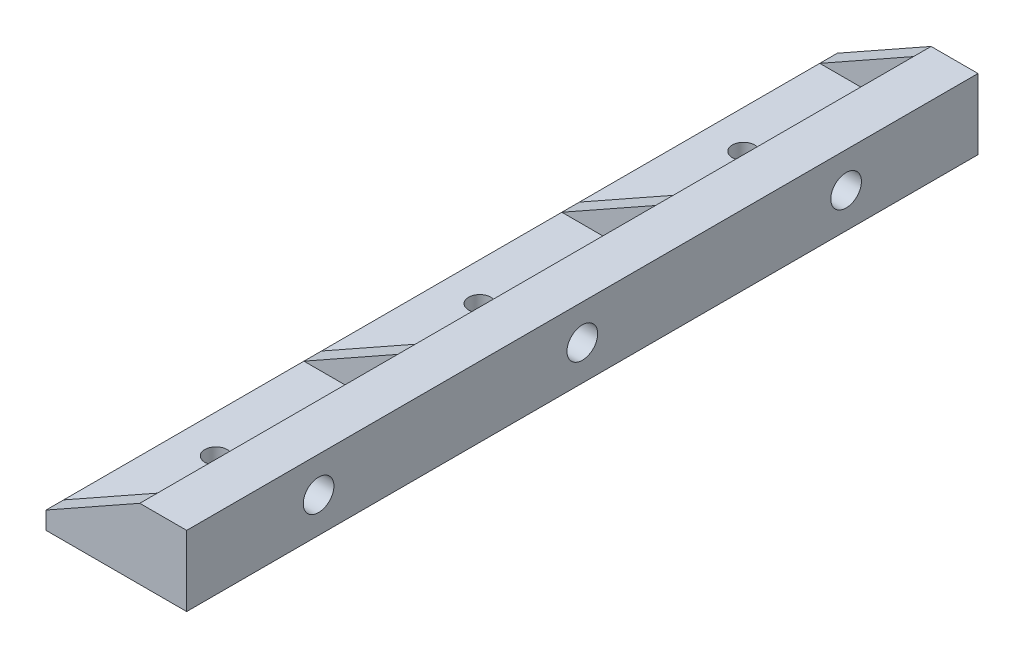
ISO-10303-21;
HEADER;
FILE_DESCRIPTION(('STEP AP214'),'2;1');
FILE_NAME('part.step','',(''),(''),'','','');
FILE_SCHEMA(('AUTOMOTIVE_DESIGN { 1 0 10303 214 1 1 1 1 }'));
ENDSEC;
DATA;
#1=APPLICATION_CONTEXT('core data for automotive mechanical design processes');
#2=APPLICATION_PROTOCOL_DEFINITION('international standard','automotive_design',2000,#1);
#3=PRODUCT_CONTEXT('',#1,'mechanical');
#4=PRODUCT('Part','Part','',(#3));
#5=PRODUCT_RELATED_PRODUCT_CATEGORY('part','',(#4));
#6=PRODUCT_DEFINITION_FORMATION('','',#4);
#7=PRODUCT_DEFINITION_CONTEXT('part definition',#1,'design');
#8=PRODUCT_DEFINITION('design','',#6,#7);
#9=PRODUCT_DEFINITION_SHAPE('','',#8);
#10=(LENGTH_UNIT() NAMED_UNIT(*) SI_UNIT(.MILLI.,.METRE.));
#11=(NAMED_UNIT(*) PLANE_ANGLE_UNIT() SI_UNIT($,.RADIAN.));
#12=(NAMED_UNIT(*) SI_UNIT($,.STERADIAN.) SOLID_ANGLE_UNIT());
#13=UNCERTAINTY_MEASURE_WITH_UNIT(LENGTH_MEASURE(1.E-05),#10,'distance_accuracy_value','');
#14=(GEOMETRIC_REPRESENTATION_CONTEXT(3) GLOBAL_UNCERTAINTY_ASSIGNED_CONTEXT((#13)) GLOBAL_UNIT_ASSIGNED_CONTEXT((#10,
#11,#12)) REPRESENTATION_CONTEXT('',''));
#15=CARTESIAN_POINT('',(0.,0.,0.));
#16=DIRECTION('',(0.,0.,1.));
#17=DIRECTION('',(1.,0.,0.));
#18=AXIS2_PLACEMENT_3D('',#15,#16,#17);
#19=CARTESIAN_POINT('',(-11.,6.,135.));
#20=DIRECTION('',(0.,0.,-1.));
#21=DIRECTION('',(-1.,0.,0.));
#22=AXIS2_PLACEMENT_3D('',#19,#20,#21);
#23=CYLINDRICAL_SURFACE('',#22,3.);
#24=CARTESIAN_POINT('',(-11.,6.,132.));
#25=DIRECTION('',(0.,0.,1.));
#26=DIRECTION('',(1.,0.,0.));
#27=AXIS2_PLACEMENT_3D('',#24,#25,#26);
#28=CIRCLE('',#27,3.);
#29=CARTESIAN_POINT('',(-8.,6.,132.));
#30=VERTEX_POINT('',#29);
#31=CARTESIAN_POINT('',(-11.,3.,132.));
#32=VERTEX_POINT('',#31);
#33=EDGE_CURVE('E226',#30,#32,#28,.F.);
#34=ORIENTED_EDGE('',*,*,#33,.F.);
#35=DIRECTION('',(0.,0.,-1.));
#36=VECTOR('',#35,1.);
#37=CARTESIAN_POINT('',(-8.,6.,135.));
#38=LINE('',#37,#36);
#39=CARTESIAN_POINT('',(-8.,6.,91.));
#40=VERTEX_POINT('',#39);
#41=EDGE_CURVE('E205',#30,#40,#38,.T.);
#42=ORIENTED_EDGE('',*,*,#41,.T.);
#43=CARTESIAN_POINT('',(-11.,6.,91.));
#44=DIRECTION('',(0.,0.,1.));
#45=DIRECTION('',(1.,0.,0.));
#46=AXIS2_PLACEMENT_3D('',#43,#44,#45);
#47=CIRCLE('',#46,3.);
#48=CARTESIAN_POINT('',(-11.,3.,91.));
#49=VERTEX_POINT('',#48);
#50=EDGE_CURVE('E241',#40,#49,#47,.F.);
#51=ORIENTED_EDGE('',*,*,#50,.T.);
#52=DIRECTION('',(0.,0.,-1.));
#53=VECTOR('',#52,1.);
#54=CARTESIAN_POINT('',(-11.,3.,135.));
#55=LINE('',#54,#53);
#56=EDGE_CURVE('E65',#32,#49,#55,.T.);
#57=ORIENTED_EDGE('',*,*,#56,.F.);
#58=EDGE_LOOP('',(#34,#42,#51,#57));
#59=FACE_BOUND('',#58,.T.);
#60=ADVANCED_FACE('F40',(#59),#23,.F.);
#61=CARTESIAN_POINT('',(-11.,3.,135.));
#62=DIRECTION('',(0.,-1.,0.));
#63=DIRECTION('',(1.,0.,0.));
#64=AXIS2_PLACEMENT_3D('',#61,#62,#63);
#65=PLANE('',#64);
#66=CARTESIAN_POINT('',(-17.5,3.,112.5));
#67=DIRECTION('',(0.,-1.,0.));
#68=DIRECTION('',(1.,0.,0.));
#69=AXIS2_PLACEMENT_3D('',#66,#67,#68);
#70=CIRCLE('',#69,1.89865);
#71=CARTESIAN_POINT('',(-15.60135,3.,112.5));
#72=VERTEX_POINT('',#71);
#73=EDGE_CURVE('E386',#72,#72,#70,.T.);
#74=ORIENTED_EDGE('',*,*,#73,.T.);
#75=EDGE_LOOP('',(#74));
#76=FACE_BOUND('',#75,.T.);
#77=DIRECTION('',(-1.,0.,0.));
#78=VECTOR('',#77,1.);
#79=CARTESIAN_POINT('',(-11.,3.,132.));
#80=LINE('',#79,#78);
#81=CARTESIAN_POINT('',(-24.,3.,132.));
#82=VERTEX_POINT('',#81);
#83=EDGE_CURVE('E229',#32,#82,#80,.T.);
#84=ORIENTED_EDGE('',*,*,#83,.F.);
#85=ORIENTED_EDGE('',*,*,#56,.T.);
#86=DIRECTION('',(-1.,0.,0.));
#87=VECTOR('',#86,1.);
#88=CARTESIAN_POINT('',(-11.,3.,91.));
#89=LINE('',#88,#87);
#90=CARTESIAN_POINT('',(-24.,3.,91.));
#91=VERTEX_POINT('',#90);
#92=EDGE_CURVE('E239',#49,#91,#89,.T.);
#93=ORIENTED_EDGE('',*,*,#92,.T.);
#94=DIRECTION('',(0.,0.,-1.));
#95=VECTOR('',#94,1.);
#96=CARTESIAN_POINT('',(-24.,3.,135.));
#97=LINE('',#96,#95);
#98=EDGE_CURVE('E347',#82,#91,#97,.T.);
#99=ORIENTED_EDGE('',*,*,#98,.F.);
#100=EDGE_LOOP('',(#84,#85,#93,#99));
#101=FACE_BOUND('',#100,.T.);
#102=ADVANCED_FACE('F398',(#76,#101),#65,.F.);
#103=CARTESIAN_POINT('',(-8.,12.,135.));
#104=DIRECTION('',(1.,0.,0.));
#105=DIRECTION('',(0.,0.,-1.));
#106=AXIS2_PLACEMENT_3D('',#103,#104,#105);
#107=PLANE('',#106);
#108=DIRECTION('',(0.,-1.,0.));
#109=VECTOR('',#108,1.);
#110=CARTESIAN_POINT('',(-8.,12.,132.));
#111=LINE('',#110,#109);
#112=CARTESIAN_POINT('',(-8.,12.,132.));
#113=VERTEX_POINT('',#112);
#114=EDGE_CURVE('E173',#113,#30,#111,.T.);
#115=ORIENTED_EDGE('',*,*,#114,.F.);
#116=DIRECTION('',(0.,0.,-1.));
#117=VECTOR('',#116,1.);
#118=CARTESIAN_POINT('',(-8.,12.,135.));
#119=LINE('',#118,#117);
#120=CARTESIAN_POINT('',(-8.,12.,91.));
#121=VERTEX_POINT('',#120);
#122=EDGE_CURVE('E188',#113,#121,#119,.T.);
#123=ORIENTED_EDGE('',*,*,#122,.T.);
#124=DIRECTION('',(0.,-1.,0.));
#125=VECTOR('',#124,1.);
#126=CARTESIAN_POINT('',(-8.,12.,91.));
#127=LINE('',#126,#125);
#128=EDGE_CURVE('E236',#121,#40,#127,.T.);
#129=ORIENTED_EDGE('',*,*,#128,.T.);
#130=ORIENTED_EDGE('',*,*,#41,.F.);
#131=EDGE_LOOP('',(#115,#123,#129,#130));
#132=FACE_BOUND('',#131,.T.);
#133=ADVANCED_FACE('F425',(#132),#107,.F.);
#134=CARTESIAN_POINT('',(-11.,6.,88.));
#135=DIRECTION('',(0.,0.,1.));
#136=DIRECTION('',(1.,0.,0.));
#137=AXIS2_PLACEMENT_3D('',#134,#135,#136);
#138=CIRCLE('',#137,3.);
#139=CARTESIAN_POINT('',(-8.,6.,88.));
#140=VERTEX_POINT('',#139);
#141=CARTESIAN_POINT('',(-11.,3.,88.));
#142=VERTEX_POINT('',#141);
#143=EDGE_CURVE('E234',#140,#142,#138,.F.);
#144=ORIENTED_EDGE('',*,*,#143,.F.);
#145=CARTESIAN_POINT('',(-8.,6.,47.));
#146=VERTEX_POINT('',#145);
#147=EDGE_CURVE('E208',#140,#146,#38,.T.);
#148=ORIENTED_EDGE('',*,*,#147,.T.);
#149=CARTESIAN_POINT('',(-11.,6.,47.));
#150=DIRECTION('',(0.,0.,-1.));
#151=DIRECTION('',(-1.,0.,0.));
#152=AXIS2_PLACEMENT_3D('',#149,#150,#151);
#153=CIRCLE('',#152,3.);
#154=CARTESIAN_POINT('',(-11.,3.,47.));
#155=VERTEX_POINT('',#154);
#156=EDGE_CURVE('E270',#155,#146,#153,.F.);
#157=ORIENTED_EDGE('',*,*,#156,.F.);
#158=EDGE_CURVE('E338',#142,#155,#55,.T.);
#159=ORIENTED_EDGE('',*,*,#158,.F.);
#160=EDGE_LOOP('',(#144,#148,#157,#159));
#161=FACE_BOUND('',#160,.T.);
#162=ADVANCED_FACE('F326',(#161),#23,.F.);
#163=CARTESIAN_POINT('',(-17.5,3.,67.5));
#164=DIRECTION('',(0.,-1.,0.));
#165=DIRECTION('',(1.,0.,0.));
#166=AXIS2_PLACEMENT_3D('',#163,#164,#165);
#167=CIRCLE('',#166,1.89865);
#168=CARTESIAN_POINT('',(-15.60135,3.,67.5));
#169=VERTEX_POINT('',#168);
#170=EDGE_CURVE('E352',#169,#169,#167,.T.);
#171=ORIENTED_EDGE('',*,*,#170,.T.);
#172=EDGE_LOOP('',(#171));
#173=FACE_BOUND('',#172,.T.);
#174=DIRECTION('',(-1.,0.,0.));
#175=VECTOR('',#174,1.);
#176=CARTESIAN_POINT('',(-11.,3.,88.));
#177=LINE('',#176,#175);
#178=CARTESIAN_POINT('',(-24.,3.,88.));
#179=VERTEX_POINT('',#178);
#180=EDGE_CURVE('E57',#142,#179,#177,.T.);
#181=ORIENTED_EDGE('',*,*,#180,.F.);
#182=ORIENTED_EDGE('',*,*,#158,.T.);
#183=DIRECTION('',(1.,0.,0.));
#184=VECTOR('',#183,1.);
#185=CARTESIAN_POINT('',(-11.,3.,47.));
#186=LINE('',#185,#184);
#187=CARTESIAN_POINT('',(-24.,3.,47.));
#188=VERTEX_POINT('',#187);
#189=EDGE_CURVE('E265',#188,#155,#186,.T.);
#190=ORIENTED_EDGE('',*,*,#189,.F.);
#191=EDGE_CURVE('E336',#179,#188,#97,.T.);
#192=ORIENTED_EDGE('',*,*,#191,.F.);
#193=EDGE_LOOP('',(#181,#182,#190,#192));
#194=FACE_BOUND('',#193,.T.);
#195=ADVANCED_FACE('F335',(#173,#194),#65,.F.);
#196=DIRECTION('',(0.,-1.,0.));
#197=VECTOR('',#196,1.);
#198=CARTESIAN_POINT('',(-8.,12.,88.));
#199=LINE('',#198,#197);
#200=CARTESIAN_POINT('',(-8.,12.,88.));
#201=VERTEX_POINT('',#200);
#202=EDGE_CURVE('E225',#201,#140,#199,.T.);
#203=ORIENTED_EDGE('',*,*,#202,.F.);
#204=CARTESIAN_POINT('',(-8.,12.,47.));
#205=VERTEX_POINT('',#204);
#206=EDGE_CURVE('E195',#201,#205,#119,.T.);
#207=ORIENTED_EDGE('',*,*,#206,.T.);
#208=DIRECTION('',(0.,1.,0.));
#209=VECTOR('',#208,1.);
#210=CARTESIAN_POINT('',(-8.,12.,47.));
#211=LINE('',#210,#209);
#212=EDGE_CURVE('E329',#146,#205,#211,.T.);
#213=ORIENTED_EDGE('',*,*,#212,.F.);
#214=ORIENTED_EDGE('',*,*,#147,.F.);
#215=EDGE_LOOP('',(#203,#207,#213,#214));
#216=FACE_BOUND('',#215,.T.);
#217=ADVANCED_FACE('F330',(#216),#107,.F.);
#218=CARTESIAN_POINT('',(-11.,6.,3.));
#219=DIRECTION('',(0.,0.,-1.));
#220=DIRECTION('',(-1.,0.,0.));
#221=AXIS2_PLACEMENT_3D('',#218,#219,#220);
#222=CIRCLE('',#221,3.);
#223=CARTESIAN_POINT('',(-11.,3.,3.));
#224=VERTEX_POINT('',#223);
#225=CARTESIAN_POINT('',(-8.,6.,3.));
#226=VERTEX_POINT('',#225);
#227=EDGE_CURVE('E259',#224,#226,#222,.F.);
#228=ORIENTED_EDGE('',*,*,#227,.F.);
#229=CARTESIAN_POINT('',(-11.,3.,44.));
#230=VERTEX_POINT('',#229);
#231=EDGE_CURVE('E345',#230,#224,#55,.T.);
#232=ORIENTED_EDGE('',*,*,#231,.F.);
#233=CARTESIAN_POINT('',(-11.,6.,44.));
#234=DIRECTION('',(0.,0.,-1.));
#235=DIRECTION('',(-1.,0.,0.));
#236=AXIS2_PLACEMENT_3D('',#233,#234,#235);
#237=CIRCLE('',#236,3.);
#238=CARTESIAN_POINT('',(-8.,6.,44.));
#239=VERTEX_POINT('',#238);
#240=EDGE_CURVE('E275',#230,#239,#237,.F.);
#241=ORIENTED_EDGE('',*,*,#240,.T.);
#242=EDGE_CURVE('E183',#239,#226,#38,.T.);
#243=ORIENTED_EDGE('',*,*,#242,.T.);
#244=EDGE_LOOP('',(#228,#232,#241,#243));
#245=FACE_BOUND('',#244,.T.);
#246=ADVANCED_FACE('F42',(#245),#23,.F.);
#247=CARTESIAN_POINT('',(-17.5,3.,22.5));
#248=DIRECTION('',(0.,-1.,0.));
#249=DIRECTION('',(1.,0.,0.));
#250=AXIS2_PLACEMENT_3D('',#247,#248,#249);
#251=CIRCLE('',#250,1.89865);
#252=CARTESIAN_POINT('',(-15.60135,3.,22.5));
#253=VERTEX_POINT('',#252);
#254=EDGE_CURVE('E380',#253,#253,#251,.T.);
#255=ORIENTED_EDGE('',*,*,#254,.T.);
#256=EDGE_LOOP('',(#255));
#257=FACE_BOUND('',#256,.T.);
#258=DIRECTION('',(1.,0.,0.));
#259=VECTOR('',#258,1.);
#260=CARTESIAN_POINT('',(-11.,3.,3.));
#261=LINE('',#260,#259);
#262=CARTESIAN_POINT('',(-24.,3.,3.));
#263=VERTEX_POINT('',#262);
#264=EDGE_CURVE('E256',#263,#224,#261,.T.);
#265=ORIENTED_EDGE('',*,*,#264,.F.);
#266=CARTESIAN_POINT('',(-24.,3.,44.));
#267=VERTEX_POINT('',#266);
#268=EDGE_CURVE('E311',#267,#263,#97,.T.);
#269=ORIENTED_EDGE('',*,*,#268,.F.);
#270=DIRECTION('',(1.,0.,0.));
#271=VECTOR('',#270,1.);
#272=CARTESIAN_POINT('',(-11.,3.,44.));
#273=LINE('',#272,#271);
#274=EDGE_CURVE('E273',#267,#230,#273,.T.);
#275=ORIENTED_EDGE('',*,*,#274,.T.);
#276=ORIENTED_EDGE('',*,*,#231,.T.);
#277=EDGE_LOOP('',(#265,#269,#275,#276));
#278=FACE_BOUND('',#277,.T.);
#279=ADVANCED_FACE('F344',(#257,#278),#65,.F.);
#280=DIRECTION('',(0.,1.,0.));
#281=VECTOR('',#280,1.);
#282=CARTESIAN_POINT('',(-8.,12.,3.));
#283=LINE('',#282,#281);
#284=CARTESIAN_POINT('',(-8.,12.,3.));
#285=VERTEX_POINT('',#284);
#286=EDGE_CURVE('E12',#226,#285,#283,.T.);
#287=ORIENTED_EDGE('',*,*,#286,.F.);
#288=ORIENTED_EDGE('',*,*,#242,.F.);
#289=DIRECTION('',(0.,1.,0.));
#290=VECTOR('',#289,1.);
#291=CARTESIAN_POINT('',(-8.,12.,44.));
#292=LINE('',#291,#290);
#293=CARTESIAN_POINT('',(-8.,12.,44.));
#294=VERTEX_POINT('',#293);
#295=EDGE_CURVE('E49',#239,#294,#292,.T.);
#296=ORIENTED_EDGE('',*,*,#295,.T.);
#297=EDGE_CURVE('E198',#294,#285,#119,.T.);
#298=ORIENTED_EDGE('',*,*,#297,.T.);
#299=EDGE_LOOP('',(#287,#288,#296,#298));
#300=FACE_BOUND('',#299,.T.);
#301=ADVANCED_FACE('F316',(#300),#107,.F.);
#302=CARTESIAN_POINT('',(-24.,3.,135.));
#303=DIRECTION('',(1.,0.,0.));
#304=DIRECTION('',(0.,0.,-1.));
#305=AXIS2_PLACEMENT_3D('',#302,#303,#304);
#306=PLANE('',#305);
#307=CARTESIAN_POINT('',(-24.,3.,135.));
#308=VERTEX_POINT('',#307);
#309=EDGE_CURVE('E170',#308,#82,#97,.T.);
#310=ORIENTED_EDGE('',*,*,#309,.T.);
#311=ORIENTED_EDGE('',*,*,#98,.T.);
#312=DIRECTION('',(0.,0.,1.));
#313=VECTOR('',#312,1.);
#314=CARTESIAN_POINT('',(-24.,3.,135.));
#315=LINE('',#314,#313);
#316=EDGE_CURVE('E243',#179,#91,#315,.T.);
#317=ORIENTED_EDGE('',*,*,#316,.F.);
#318=ORIENTED_EDGE('',*,*,#191,.T.);
#319=DIRECTION('',(0.,0.,-1.));
#320=VECTOR('',#319,1.);
#321=CARTESIAN_POINT('',(-24.,3.,135.));
#322=LINE('',#321,#320);
#323=EDGE_CURVE('E277',#267,#188,#322,.F.);
#324=ORIENTED_EDGE('',*,*,#323,.F.);
#325=ORIENTED_EDGE('',*,*,#268,.T.);
#326=DIRECTION('',(0.,0.,-1.));
#327=VECTOR('',#326,1.);
#328=CARTESIAN_POINT('',(-24.,3.,135.));
#329=LINE('',#328,#327);
#330=CARTESIAN_POINT('',(-24.,3.,0.));
#331=VERTEX_POINT('',#330);
#332=EDGE_CURVE('E253',#331,#263,#329,.F.);
#333=ORIENTED_EDGE('',*,*,#332,.F.);
#334=DIRECTION('',(0.,-1.,0.));
#335=VECTOR('',#334,1.);
#336=CARTESIAN_POINT('',(-24.,3.,0.));
#337=LINE('',#336,#335);
#338=CARTESIAN_POINT('',(-24.,0.,0.));
#339=VERTEX_POINT('',#338);
#340=EDGE_CURVE('E280',#331,#339,#337,.T.);
#341=ORIENTED_EDGE('',*,*,#340,.T.);
#342=DIRECTION('',(0.,0.,-1.));
#343=VECTOR('',#342,1.);
#344=CARTESIAN_POINT('',(-24.,0.,135.));
#345=LINE('',#344,#343);
#346=CARTESIAN_POINT('',(-24.,0.,135.));
#347=VERTEX_POINT('',#346);
#348=EDGE_CURVE('E400',#347,#339,#345,.T.);
#349=ORIENTED_EDGE('',*,*,#348,.F.);
#350=DIRECTION('',(0.,-1.,0.));
#351=VECTOR('',#350,1.);
#352=CARTESIAN_POINT('',(-24.,3.,135.));
#353=LINE('',#352,#351);
#354=EDGE_CURVE('E281',#308,#347,#353,.T.);
#355=ORIENTED_EDGE('',*,*,#354,.F.);
#356=EDGE_LOOP('',(#310,#311,#317,#318,#324,#325,#333,#341,#349,#355));
#357=FACE_BOUND('',#356,.T.);
#358=ADVANCED_FACE('F309',(#357),#306,.F.);
#359=CARTESIAN_POINT('',(-24.,0.,135.));
#360=DIRECTION('',(0.,1.,0.));
#361=DIRECTION('',(0.,0.,1.));
#362=AXIS2_PLACEMENT_3D('',#359,#360,#361);
#363=PLANE('',#362);
#364=CARTESIAN_POINT('',(-17.5,0.,22.5));
#365=DIRECTION('',(0.,-1.,0.));
#366=DIRECTION('',(0.,0.,-1.));
#367=AXIS2_PLACEMENT_3D('',#364,#365,#366);
#368=CIRCLE('',#367,1.89865);
#369=CARTESIAN_POINT('',(-17.5,0.,20.60135));
#370=VERTEX_POINT('',#369);
#371=EDGE_CURVE('E377',#370,#370,#368,.T.);
#372=ORIENTED_EDGE('',*,*,#371,.F.);
#373=EDGE_LOOP('',(#372));
#374=FACE_BOUND('',#373,.T.);
#375=CARTESIAN_POINT('',(-17.5,0.,112.5));
#376=DIRECTION('',(0.,-1.,0.));
#377=DIRECTION('',(0.,0.,-1.));
#378=AXIS2_PLACEMENT_3D('',#375,#376,#377);
#379=CIRCLE('',#378,1.89865);
#380=CARTESIAN_POINT('',(-17.5,0.,110.60135));
#381=VERTEX_POINT('',#380);
#382=EDGE_CURVE('E383',#381,#381,#379,.T.);
#383=ORIENTED_EDGE('',*,*,#382,.F.);
#384=EDGE_LOOP('',(#383));
#385=FACE_BOUND('',#384,.T.);
#386=CARTESIAN_POINT('',(-17.5,0.,67.5));
#387=DIRECTION('',(0.,-1.,0.));
#388=DIRECTION('',(0.,0.,-1.));
#389=AXIS2_PLACEMENT_3D('',#386,#387,#388);
#390=CIRCLE('',#389,1.89865);
#391=CARTESIAN_POINT('',(-17.5,0.,65.60135));
#392=VERTEX_POINT('',#391);
#393=EDGE_CURVE('E355',#392,#392,#390,.T.);
#394=ORIENTED_EDGE('',*,*,#393,.F.);
#395=EDGE_LOOP('',(#394));
#396=FACE_BOUND('',#395,.T.);
#397=ORIENTED_EDGE('',*,*,#348,.T.);
#398=DIRECTION('',(1.,0.,0.));
#399=VECTOR('',#398,1.);
#400=CARTESIAN_POINT('',(-24.,0.,0.));
#401=LINE('',#400,#399);
#402=CARTESIAN_POINT('',(0.,0.,0.));
#403=VERTEX_POINT('',#402);
#404=EDGE_CURVE('E289',#339,#403,#401,.T.);
#405=ORIENTED_EDGE('',*,*,#404,.T.);
#406=DIRECTION('',(0.,0.,-1.));
#407=VECTOR('',#406,1.);
#408=CARTESIAN_POINT('',(0.,0.,135.));
#409=LINE('',#408,#407);
#410=CARTESIAN_POINT('',(0.,0.,135.));
#411=VERTEX_POINT('',#410);
#412=EDGE_CURVE('E192',#411,#403,#409,.T.);
#413=ORIENTED_EDGE('',*,*,#412,.F.);
#414=DIRECTION('',(1.,0.,0.));
#415=VECTOR('',#414,1.);
#416=CARTESIAN_POINT('',(-24.,0.,135.));
#417=LINE('',#416,#415);
#418=EDGE_CURVE('E283',#347,#411,#417,.T.);
#419=ORIENTED_EDGE('',*,*,#418,.F.);
#420=EDGE_LOOP('',(#397,#405,#413,#419));
#421=FACE_BOUND('',#420,.T.);
#422=ADVANCED_FACE('F404',(#374,#385,#396,#421),#363,.F.);
#423=CARTESIAN_POINT('',(0.,0.,135.));
#424=DIRECTION('',(-1.,0.,0.));
#425=DIRECTION('',(0.,0.,1.));
#426=AXIS2_PLACEMENT_3D('',#423,#424,#425);
#427=PLANE('',#426);
#428=CARTESIAN_POINT('',(0.,6.,112.5));
#429=DIRECTION('',(1.,0.,0.));
#430=DIRECTION('',(0.,0.,-1.));
#431=AXIS2_PLACEMENT_3D('',#428,#429,#430);
#432=CIRCLE('',#431,2.6162);
#433=CARTESIAN_POINT('',(0.,6.,109.8838));
#434=VERTEX_POINT('',#433);
#435=EDGE_CURVE('E768',#434,#434,#432,.T.);
#436=ORIENTED_EDGE('',*,*,#435,.F.);
#437=EDGE_LOOP('',(#436));
#438=FACE_BOUND('',#437,.T.);
#439=CARTESIAN_POINT('',(0.,6.,67.5));
#440=DIRECTION('',(1.,0.,0.));
#441=DIRECTION('',(0.,0.,-1.));
#442=AXIS2_PLACEMENT_3D('',#439,#440,#441);
#443=CIRCLE('',#442,2.6162);
#444=CARTESIAN_POINT('',(0.,6.,64.8838));
#445=VERTEX_POINT('',#444);
#446=EDGE_CURVE('E762',#445,#445,#443,.T.);
#447=ORIENTED_EDGE('',*,*,#446,.F.);
#448=EDGE_LOOP('',(#447));
#449=FACE_BOUND('',#448,.T.);
#450=CARTESIAN_POINT('',(0.,6.,22.5));
#451=DIRECTION('',(1.,0.,0.));
#452=DIRECTION('',(0.,0.,-1.));
#453=AXIS2_PLACEMENT_3D('',#450,#451,#452);
#454=CIRCLE('',#453,2.6162);
#455=CARTESIAN_POINT('',(0.,6.,19.8838));
#456=VERTEX_POINT('',#455);
#457=EDGE_CURVE('E756',#456,#456,#454,.T.);
#458=ORIENTED_EDGE('',*,*,#457,.F.);
#459=EDGE_LOOP('',(#458));
#460=FACE_BOUND('',#459,.T.);
#461=ORIENTED_EDGE('',*,*,#412,.T.);
#462=DIRECTION('',(0.,1.,0.));
#463=VECTOR('',#462,1.);
#464=CARTESIAN_POINT('',(0.,0.,0.));
#465=LINE('',#464,#463);
#466=CARTESIAN_POINT('',(0.,12.,0.));
#467=VERTEX_POINT('',#466);
#468=EDGE_CURVE('E292',#403,#467,#465,.T.);
#469=ORIENTED_EDGE('',*,*,#468,.T.);
#470=DIRECTION('',(0.,0.,-1.));
#471=VECTOR('',#470,1.);
#472=CARTESIAN_POINT('',(0.,12.,135.));
#473=LINE('',#472,#471);
#474=CARTESIAN_POINT('',(0.,12.,135.));
#475=VERTEX_POINT('',#474);
#476=EDGE_CURVE('E189',#475,#467,#473,.T.);
#477=ORIENTED_EDGE('',*,*,#476,.F.);
#478=DIRECTION('',(0.,1.,0.));
#479=VECTOR('',#478,1.);
#480=CARTESIAN_POINT('',(0.,0.,135.));
#481=LINE('',#480,#479);
#482=EDGE_CURVE('E180',#411,#475,#481,.T.);
#483=ORIENTED_EDGE('',*,*,#482,.F.);
#484=EDGE_LOOP('',(#461,#469,#477,#483));
#485=FACE_BOUND('',#484,.T.);
#486=ADVANCED_FACE('F407',(#438,#449,#460,#485),#427,.F.);
#487=CARTESIAN_POINT('',(0.,12.,135.));
#488=DIRECTION('',(0.,-1.,0.));
#489=DIRECTION('',(1.,0.,0.));
#490=AXIS2_PLACEMENT_3D('',#487,#488,#489);
#491=PLANE('',#490);
#492=ORIENTED_EDGE('',*,*,#476,.T.);
#493=DIRECTION('',(-1.,0.,0.));
#494=VECTOR('',#493,1.);
#495=CARTESIAN_POINT('',(0.,12.,0.));
#496=LINE('',#495,#494);
#497=CARTESIAN_POINT('',(-8.,12.,0.));
#498=VERTEX_POINT('',#497);
#499=EDGE_CURVE('E284',#467,#498,#496,.T.);
#500=ORIENTED_EDGE('',*,*,#499,.T.);
#501=DIRECTION('',(0.,0.,-1.));
#502=VECTOR('',#501,1.);
#503=CARTESIAN_POINT('',(-8.,12.,135.));
#504=LINE('',#503,#502);
#505=EDGE_CURVE('E249',#498,#285,#504,.F.);
#506=ORIENTED_EDGE('',*,*,#505,.T.);
#507=ORIENTED_EDGE('',*,*,#297,.F.);
#508=EDGE_CURVE('E191',#205,#294,#119,.T.);
#509=ORIENTED_EDGE('',*,*,#508,.F.);
#510=ORIENTED_EDGE('',*,*,#206,.F.);
#511=EDGE_CURVE('E194',#121,#201,#119,.T.);
#512=ORIENTED_EDGE('',*,*,#511,.F.);
#513=ORIENTED_EDGE('',*,*,#122,.F.);
#514=CARTESIAN_POINT('',(-8.,12.,135.));
#515=VERTEX_POINT('',#514);
#516=EDGE_CURVE('E167',#515,#113,#119,.T.);
#517=ORIENTED_EDGE('',*,*,#516,.F.);
#518=DIRECTION('',(-1.,0.,0.));
#519=VECTOR('',#518,1.);
#520=CARTESIAN_POINT('',(0.,12.,135.));
#521=LINE('',#520,#519);
#522=EDGE_CURVE('E177',#475,#515,#521,.T.);
#523=ORIENTED_EDGE('',*,*,#522,.F.);
#524=EDGE_LOOP('',(#492,#500,#506,#507,#509,#510,#512,#513,#517,#523));
#525=FACE_BOUND('',#524,.T.);
#526=ADVANCED_FACE('F186',(#525),#491,.F.);
#527=CARTESIAN_POINT('',(-11.,6.,135.));
#528=DIRECTION('',(0.,0.,-1.));
#529=DIRECTION('',(-1.,0.,0.));
#530=AXIS2_PLACEMENT_3D('',#527,#528,#529);
#531=PLANE('',#530);
#532=DIRECTION('',(-0.871575537124549,-0.490261239632559,0.));
#533=VECTOR('',#532,1.);
#534=CARTESIAN_POINT('',(-8.,12.,135.));
#535=LINE('',#534,#533);
#536=EDGE_CURVE('E162',#515,#308,#535,.T.);
#537=ORIENTED_EDGE('',*,*,#536,.T.);
#538=ORIENTED_EDGE('',*,*,#354,.T.);
#539=ORIENTED_EDGE('',*,*,#418,.T.);
#540=ORIENTED_EDGE('',*,*,#482,.T.);
#541=ORIENTED_EDGE('',*,*,#522,.T.);
#542=EDGE_LOOP('',(#537,#538,#539,#540,#541));
#543=FACE_BOUND('',#542,.T.);
#544=ADVANCED_FACE('F178',(#543),#531,.F.);
#545=CARTESIAN_POINT('',(-11.,6.,0.));
#546=DIRECTION('',(0.,0.,-1.));
#547=DIRECTION('',(-1.,0.,0.));
#548=AXIS2_PLACEMENT_3D('',#545,#546,#547);
#549=PLANE('',#548);
#550=DIRECTION('',(-0.871575537124549,-0.490261239632559,0.));
#551=VECTOR('',#550,1.);
#552=CARTESIAN_POINT('',(-8.,12.,0.));
#553=LINE('',#552,#551);
#554=EDGE_CURVE('E246',#498,#331,#553,.T.);
#555=ORIENTED_EDGE('',*,*,#554,.F.);
#556=ORIENTED_EDGE('',*,*,#499,.F.);
#557=ORIENTED_EDGE('',*,*,#468,.F.);
#558=ORIENTED_EDGE('',*,*,#404,.F.);
#559=ORIENTED_EDGE('',*,*,#340,.F.);
#560=EDGE_LOOP('',(#555,#556,#557,#558,#559));
#561=FACE_BOUND('',#560,.T.);
#562=ADVANCED_FACE('F303',(#561),#549,.T.);
#563=CARTESIAN_POINT('',(-8.,12.,45.5));
#564=DIRECTION('',(0.490261239632559,-0.871575537124549,0.));
#565=DIRECTION('',(-0.871575537124549,-0.490261239632559,0.));
#566=AXIS2_PLACEMENT_3D('',#563,#564,#565);
#567=PLANE('',#566);
#568=DIRECTION('',(-0.871575537124549,-0.490261239632559,0.));
#569=VECTOR('',#568,1.);
#570=CARTESIAN_POINT('',(-8.,12.,44.));
#571=LINE('',#570,#569);
#572=EDGE_CURVE('E263',#294,#267,#571,.T.);
#573=ORIENTED_EDGE('',*,*,#572,.T.);
#574=ORIENTED_EDGE('',*,*,#323,.T.);
#575=DIRECTION('',(-0.871575537124549,-0.490261239632559,0.));
#576=VECTOR('',#575,1.);
#577=CARTESIAN_POINT('',(-8.,12.,47.));
#578=LINE('',#577,#576);
#579=EDGE_CURVE('E262',#205,#188,#578,.T.);
#580=ORIENTED_EDGE('',*,*,#579,.F.);
#581=ORIENTED_EDGE('',*,*,#508,.T.);
#582=EDGE_LOOP('',(#573,#574,#580,#581));
#583=FACE_BOUND('',#582,.T.);
#584=ADVANCED_FACE('F339',(#583),#567,.F.);
#585=CARTESIAN_POINT('',(-12.,6.,44.));
#586=DIRECTION('',(0.,0.,-1.));
#587=DIRECTION('',(-1.,0.,0.));
#588=AXIS2_PLACEMENT_3D('',#585,#586,#587);
#589=PLANE('',#588);
#590=ORIENTED_EDGE('',*,*,#240,.F.);
#591=ORIENTED_EDGE('',*,*,#274,.F.);
#592=ORIENTED_EDGE('',*,*,#572,.F.);
#593=ORIENTED_EDGE('',*,*,#295,.F.);
#594=EDGE_LOOP('',(#590,#591,#592,#593));
#595=FACE_BOUND('',#594,.T.);
#596=ADVANCED_FACE('F342',(#595),#589,.T.);
#597=CARTESIAN_POINT('',(-12.,6.,47.));
#598=DIRECTION('',(0.,0.,-1.));
#599=DIRECTION('',(-1.,0.,0.));
#600=AXIS2_PLACEMENT_3D('',#597,#598,#599);
#601=PLANE('',#600);
#602=ORIENTED_EDGE('',*,*,#189,.T.);
#603=ORIENTED_EDGE('',*,*,#156,.T.);
#604=ORIENTED_EDGE('',*,*,#212,.T.);
#605=ORIENTED_EDGE('',*,*,#579,.T.);
#606=EDGE_LOOP('',(#602,#603,#604,#605));
#607=FACE_BOUND('',#606,.T.);
#608=ADVANCED_FACE('F333',(#607),#601,.F.);
#609=CARTESIAN_POINT('',(-12.,6.,3.));
#610=DIRECTION('',(0.,0.,-1.));
#611=DIRECTION('',(-1.,0.,0.));
#612=AXIS2_PLACEMENT_3D('',#609,#610,#611);
#613=PLANE('',#612);
#614=ORIENTED_EDGE('',*,*,#264,.T.);
#615=ORIENTED_EDGE('',*,*,#227,.T.);
#616=ORIENTED_EDGE('',*,*,#286,.T.);
#617=DIRECTION('',(-0.871575537124549,-0.490261239632559,0.));
#618=VECTOR('',#617,1.);
#619=CARTESIAN_POINT('',(-8.,12.,3.));
#620=LINE('',#619,#618);
#621=EDGE_CURVE('E245',#285,#263,#620,.T.);
#622=ORIENTED_EDGE('',*,*,#621,.T.);
#623=EDGE_LOOP('',(#614,#615,#616,#622));
#624=FACE_BOUND('',#623,.T.);
#625=ADVANCED_FACE('F313',(#624),#613,.F.);
#626=CARTESIAN_POINT('',(-8.,12.,0.));
#627=DIRECTION('',(0.490261239632559,-0.871575537124549,0.));
#628=DIRECTION('',(-0.871575537124549,-0.490261239632559,0.));
#629=AXIS2_PLACEMENT_3D('',#626,#627,#628);
#630=PLANE('',#629);
#631=ORIENTED_EDGE('',*,*,#554,.T.);
#632=ORIENTED_EDGE('',*,*,#332,.T.);
#633=ORIENTED_EDGE('',*,*,#621,.F.);
#634=ORIENTED_EDGE('',*,*,#505,.F.);
#635=EDGE_LOOP('',(#631,#632,#633,#634));
#636=FACE_BOUND('',#635,.T.);
#637=ADVANCED_FACE('F302',(#636),#630,.F.);
#638=CARTESIAN_POINT('',(-12.,6.,91.));
#639=DIRECTION('',(0.,0.,1.));
#640=DIRECTION('',(1.,0.,0.));
#641=AXIS2_PLACEMENT_3D('',#638,#639,#640);
#642=PLANE('',#641);
#643=ORIENTED_EDGE('',*,*,#50,.F.);
#644=ORIENTED_EDGE('',*,*,#128,.F.);
#645=DIRECTION('',(-0.871575537124549,-0.490261239632559,0.));
#646=VECTOR('',#645,1.);
#647=CARTESIAN_POINT('',(-8.,12.,91.));
#648=LINE('',#647,#646);
#649=EDGE_CURVE('E218',#121,#91,#648,.T.);
#650=ORIENTED_EDGE('',*,*,#649,.T.);
#651=ORIENTED_EDGE('',*,*,#92,.F.);
#652=EDGE_LOOP('',(#643,#644,#650,#651));
#653=FACE_BOUND('',#652,.T.);
#654=ADVANCED_FACE('F448',(#653),#642,.T.);
#655=CARTESIAN_POINT('',(-12.,6.,88.));
#656=DIRECTION('',(0.,0.,1.));
#657=DIRECTION('',(1.,0.,0.));
#658=AXIS2_PLACEMENT_3D('',#655,#656,#657);
#659=PLANE('',#658);
#660=ORIENTED_EDGE('',*,*,#202,.T.);
#661=ORIENTED_EDGE('',*,*,#143,.T.);
#662=ORIENTED_EDGE('',*,*,#180,.T.);
#663=DIRECTION('',(-0.871575537124549,-0.490261239632559,0.));
#664=VECTOR('',#663,1.);
#665=CARTESIAN_POINT('',(-8.,12.,88.));
#666=LINE('',#665,#664);
#667=EDGE_CURVE('E216',#201,#179,#666,.T.);
#668=ORIENTED_EDGE('',*,*,#667,.F.);
#669=EDGE_LOOP('',(#660,#661,#662,#668));
#670=FACE_BOUND('',#669,.T.);
#671=ADVANCED_FACE('F222',(#670),#659,.F.);
#672=CARTESIAN_POINT('',(-8.,12.,89.5));
#673=DIRECTION('',(-0.490261239632559,0.871575537124549,0.));
#674=DIRECTION('',(-0.871575537124549,-0.490261239632559,0.));
#675=AXIS2_PLACEMENT_3D('',#672,#673,#674);
#676=PLANE('',#675);
#677=ORIENTED_EDGE('',*,*,#667,.T.);
#678=ORIENTED_EDGE('',*,*,#316,.T.);
#679=ORIENTED_EDGE('',*,*,#649,.F.);
#680=ORIENTED_EDGE('',*,*,#511,.T.);
#681=EDGE_LOOP('',(#677,#678,#679,#680));
#682=FACE_BOUND('',#681,.T.);
#683=ADVANCED_FACE('F214',(#682),#676,.T.);
#684=CARTESIAN_POINT('',(-12.,6.,132.));
#685=DIRECTION('',(0.,0.,1.));
#686=DIRECTION('',(1.,0.,0.));
#687=AXIS2_PLACEMENT_3D('',#684,#685,#686);
#688=PLANE('',#687);
#689=ORIENTED_EDGE('',*,*,#114,.T.);
#690=ORIENTED_EDGE('',*,*,#33,.T.);
#691=ORIENTED_EDGE('',*,*,#83,.T.);
#692=DIRECTION('',(-0.871575537124549,-0.490261239632559,0.));
#693=VECTOR('',#692,1.);
#694=CARTESIAN_POINT('',(-8.,12.,132.));
#695=LINE('',#694,#693);
#696=EDGE_CURVE('E174',#113,#82,#695,.T.);
#697=ORIENTED_EDGE('',*,*,#696,.F.);
#698=EDGE_LOOP('',(#689,#690,#691,#697));
#699=FACE_BOUND('',#698,.T.);
#700=ADVANCED_FACE('F394',(#699),#688,.F.);
#701=CARTESIAN_POINT('',(-8.,12.,135.));
#702=DIRECTION('',(-0.490261239632559,0.871575537124549,0.));
#703=DIRECTION('',(-0.871575537124549,-0.490261239632559,0.));
#704=AXIS2_PLACEMENT_3D('',#701,#702,#703);
#705=PLANE('',#704);
#706=ORIENTED_EDGE('',*,*,#696,.T.);
#707=ORIENTED_EDGE('',*,*,#309,.F.);
#708=ORIENTED_EDGE('',*,*,#536,.F.);
#709=ORIENTED_EDGE('',*,*,#516,.T.);
#710=EDGE_LOOP('',(#706,#707,#708,#709));
#711=FACE_BOUND('',#710,.T.);
#712=ADVANCED_FACE('F165',(#711),#705,.T.);
#713=CARTESIAN_POINT('',(-17.5,0.,67.5));
#714=DIRECTION('',(0.,-1.,0.));
#715=DIRECTION('',(0.,0.,-1.));
#716=AXIS2_PLACEMENT_3D('',#713,#714,#715);
#717=CYLINDRICAL_SURFACE('',#716,1.89865);
#718=ORIENTED_EDGE('',*,*,#393,.T.);
#719=EDGE_LOOP('',(#718));
#720=FACE_BOUND('',#719,.T.);
#721=ORIENTED_EDGE('',*,*,#170,.F.);
#722=EDGE_LOOP('',(#721));
#723=FACE_BOUND('',#722,.T.);
#724=ADVANCED_FACE('F570',(#720,#723),#717,.F.);
#725=CARTESIAN_POINT('',(-17.5,0.,112.5));
#726=DIRECTION('',(0.,-1.,0.));
#727=DIRECTION('',(0.,0.,-1.));
#728=AXIS2_PLACEMENT_3D('',#725,#726,#727);
#729=CYLINDRICAL_SURFACE('',#728,1.89865);
#730=ORIENTED_EDGE('',*,*,#382,.T.);
#731=EDGE_LOOP('',(#730));
#732=FACE_BOUND('',#731,.T.);
#733=ORIENTED_EDGE('',*,*,#73,.F.);
#734=EDGE_LOOP('',(#733));
#735=FACE_BOUND('',#734,.T.);
#736=ADVANCED_FACE('F601',(#732,#735),#729,.F.);
#737=CARTESIAN_POINT('',(-17.5,0.,22.5));
#738=DIRECTION('',(0.,-1.,0.));
#739=DIRECTION('',(0.,0.,-1.));
#740=AXIS2_PLACEMENT_3D('',#737,#738,#739);
#741=CYLINDRICAL_SURFACE('',#740,1.89865);
#742=ORIENTED_EDGE('',*,*,#371,.T.);
#743=EDGE_LOOP('',(#742));
#744=FACE_BOUND('',#743,.T.);
#745=ORIENTED_EDGE('',*,*,#254,.F.);
#746=EDGE_LOOP('',(#745));
#747=FACE_BOUND('',#746,.T.);
#748=ADVANCED_FACE('F611',(#744,#747),#741,.F.);
#749=CARTESIAN_POINT('',(-6.35,6.,112.5));
#750=DIRECTION('',(1.,0.,0.));
#751=DIRECTION('',(0.,0.,-1.));
#752=AXIS2_PLACEMENT_3D('',#749,#750,#751);
#753=PLANE('',#752);
#754=CARTESIAN_POINT('',(-6.35,6.,112.5));
#755=DIRECTION('',(1.,0.,0.));
#756=DIRECTION('',(0.,0.,-1.));
#757=AXIS2_PLACEMENT_3D('',#754,#755,#756);
#758=CIRCLE('',#757,2.6162);
#759=CARTESIAN_POINT('',(-6.35,6.,109.8838));
#760=VERTEX_POINT('',#759);
#761=EDGE_CURVE('E359',#760,#760,#758,.T.);
#762=ORIENTED_EDGE('',*,*,#761,.T.);
#763=EDGE_LOOP('',(#762));
#764=FACE_BOUND('',#763,.T.);
#765=CARTESIAN_POINT('',(-6.35,6.,112.5));
#766=DIRECTION('',(1.,0.,0.));
#767=DIRECTION('',(0.,0.,-1.));
#768=AXIS2_PLACEMENT_3D('',#765,#766,#767);
#769=CIRCLE('',#768,2.3495);
#770=CARTESIAN_POINT('',(-6.35,6.,110.1505));
#771=VERTEX_POINT('',#770);
#772=EDGE_CURVE('E356',#771,#771,#769,.F.);
#773=ORIENTED_EDGE('',*,*,#772,.T.);
#774=EDGE_LOOP('',(#773));
#775=FACE_BOUND('',#774,.T.);
#776=ADVANCED_FACE('F621',(#764,#775),#753,.T.);
#777=CARTESIAN_POINT('',(-6.35,6.,112.5));
#778=DIRECTION('',(1.,0.,0.));
#779=DIRECTION('',(0.,0.,-1.));
#780=AXIS2_PLACEMENT_3D('',#777,#778,#779);
#781=CYLINDRICAL_SURFACE('',#780,2.6162);
#782=ORIENTED_EDGE('',*,*,#761,.F.);
#783=EDGE_LOOP('',(#782));
#784=FACE_BOUND('',#783,.T.);
#785=ORIENTED_EDGE('',*,*,#435,.T.);
#786=EDGE_LOOP('',(#785));
#787=FACE_BOUND('',#786,.T.);
#788=ADVANCED_FACE('F673',(#784,#787),#781,.F.);
#789=CARTESIAN_POINT('',(-6.35,6.,67.5));
#790=DIRECTION('',(1.,0.,0.));
#791=DIRECTION('',(0.,0.,-1.));
#792=AXIS2_PLACEMENT_3D('',#789,#790,#791);
#793=PLANE('',#792);
#794=CARTESIAN_POINT('',(-6.35,6.,67.5));
#795=DIRECTION('',(1.,0.,0.));
#796=DIRECTION('',(0.,0.,-1.));
#797=AXIS2_PLACEMENT_3D('',#794,#795,#796);
#798=CIRCLE('',#797,2.6162);
#799=CARTESIAN_POINT('',(-6.35,6.,64.8838));
#800=VERTEX_POINT('',#799);
#801=EDGE_CURVE('E765',#800,#800,#798,.T.);
#802=ORIENTED_EDGE('',*,*,#801,.T.);
#803=EDGE_LOOP('',(#802));
#804=FACE_BOUND('',#803,.T.);
#805=CARTESIAN_POINT('',(-6.35,6.,67.5));
#806=DIRECTION('',(1.,0.,0.));
#807=DIRECTION('',(0.,0.,-1.));
#808=AXIS2_PLACEMENT_3D('',#805,#806,#807);
#809=CIRCLE('',#808,2.3495);
#810=CARTESIAN_POINT('',(-6.35,6.,65.1505));
#811=VERTEX_POINT('',#810);
#812=EDGE_CURVE('E358',#811,#811,#809,.F.);
#813=ORIENTED_EDGE('',*,*,#812,.T.);
#814=EDGE_LOOP('',(#813));
#815=FACE_BOUND('',#814,.T.);
#816=ADVANCED_FACE('F684',(#804,#815),#793,.T.);
#817=CARTESIAN_POINT('',(-6.35,6.,67.5));
#818=DIRECTION('',(1.,0.,0.));
#819=DIRECTION('',(0.,0.,-1.));
#820=AXIS2_PLACEMENT_3D('',#817,#818,#819);
#821=CYLINDRICAL_SURFACE('',#820,2.6162);
#822=ORIENTED_EDGE('',*,*,#801,.F.);
#823=EDGE_LOOP('',(#822));
#824=FACE_BOUND('',#823,.T.);
#825=ORIENTED_EDGE('',*,*,#446,.T.);
#826=EDGE_LOOP('',(#825));
#827=FACE_BOUND('',#826,.T.);
#828=ADVANCED_FACE('F694',(#824,#827),#821,.F.);
#829=CARTESIAN_POINT('',(-6.35,6.,22.5));
#830=DIRECTION('',(1.,0.,0.));
#831=DIRECTION('',(0.,0.,-1.));
#832=AXIS2_PLACEMENT_3D('',#829,#830,#831);
#833=PLANE('',#832);
#834=CARTESIAN_POINT('',(-6.35,6.,22.5));
#835=DIRECTION('',(1.,0.,0.));
#836=DIRECTION('',(0.,0.,-1.));
#837=AXIS2_PLACEMENT_3D('',#834,#835,#836);
#838=CIRCLE('',#837,2.6162);
#839=CARTESIAN_POINT('',(-6.35,6.,19.8838));
#840=VERTEX_POINT('',#839);
#841=EDGE_CURVE('E759',#840,#840,#838,.T.);
#842=ORIENTED_EDGE('',*,*,#841,.T.);
#843=EDGE_LOOP('',(#842));
#844=FACE_BOUND('',#843,.T.);
#845=CARTESIAN_POINT('',(-6.35,6.,22.5));
#846=DIRECTION('',(1.,0.,0.));
#847=DIRECTION('',(0.,0.,-1.));
#848=AXIS2_PLACEMENT_3D('',#845,#846,#847);
#849=CIRCLE('',#848,2.3495);
#850=CARTESIAN_POINT('',(-6.35,6.,20.1505));
#851=VERTEX_POINT('',#850);
#852=EDGE_CURVE('E44',#851,#851,#849,.F.);
#853=ORIENTED_EDGE('',*,*,#852,.T.);
#854=EDGE_LOOP('',(#853));
#855=FACE_BOUND('',#854,.T.);
#856=ADVANCED_FACE('F704',(#844,#855),#833,.T.);
#857=CARTESIAN_POINT('',(-6.35,6.,22.5));
#858=DIRECTION('',(1.,0.,0.));
#859=DIRECTION('',(0.,0.,-1.));
#860=AXIS2_PLACEMENT_3D('',#857,#858,#859);
#861=CYLINDRICAL_SURFACE('',#860,2.6162);
#862=ORIENTED_EDGE('',*,*,#841,.F.);
#863=EDGE_LOOP('',(#862));
#864=FACE_BOUND('',#863,.T.);
#865=ORIENTED_EDGE('',*,*,#457,.T.);
#866=EDGE_LOOP('',(#865));
#867=FACE_BOUND('',#866,.T.);
#868=ADVANCED_FACE('F658',(#864,#867),#861,.F.);
#869=CARTESIAN_POINT('',(-7.,12.,135.));
#870=DIRECTION('',(1.,0.,0.));
#871=DIRECTION('',(0.,0.,-1.));
#872=AXIS2_PLACEMENT_3D('',#869,#870,#871);
#873=PLANE('',#872);
#874=CARTESIAN_POINT('',(-7.,6.,112.5));
#875=DIRECTION('',(1.,0.,0.));
#876=DIRECTION('',(0.,0.,-1.));
#877=AXIS2_PLACEMENT_3D('',#874,#875,#876);
#878=CIRCLE('',#877,2.3495);
#879=CARTESIAN_POINT('',(-7.,6.,110.1505));
#880=VERTEX_POINT('',#879);
#881=EDGE_CURVE('E373',#880,#880,#878,.F.);
#882=ORIENTED_EDGE('',*,*,#881,.F.);
#883=EDGE_LOOP('',(#882));
#884=FACE_BOUND('',#883,.T.);
#885=ADVANCED_FACE('F655',(#884),#873,.T.);
#886=CARTESIAN_POINT('',(-14.6453895295912,6.,112.5));
#887=DIRECTION('',(1.,0.,0.));
#888=DIRECTION('',(0.,0.,-1.));
#889=AXIS2_PLACEMENT_3D('',#886,#887,#888);
#890=CYLINDRICAL_SURFACE('',#889,2.3495);
#891=ORIENTED_EDGE('',*,*,#881,.T.);
#892=EDGE_LOOP('',(#891));
#893=FACE_BOUND('',#892,.T.);
#894=ORIENTED_EDGE('',*,*,#772,.F.);
#895=EDGE_LOOP('',(#894));
#896=FACE_BOUND('',#895,.T.);
#897=ADVANCED_FACE('F647',(#893,#896),#890,.F.);
#898=CARTESIAN_POINT('',(-7.,12.,135.));
#899=DIRECTION('',(1.,0.,0.));
#900=DIRECTION('',(0.,0.,-1.));
#901=AXIS2_PLACEMENT_3D('',#898,#899,#900);
#902=PLANE('',#901);
#903=CARTESIAN_POINT('',(-7.,6.,67.5));
#904=DIRECTION('',(1.,0.,0.));
#905=DIRECTION('',(0.,0.,-1.));
#906=AXIS2_PLACEMENT_3D('',#903,#904,#905);
#907=CIRCLE('',#906,2.3495);
#908=CARTESIAN_POINT('',(-7.,6.,65.1505));
#909=VERTEX_POINT('',#908);
#910=EDGE_CURVE('E368',#909,#909,#907,.F.);
#911=ORIENTED_EDGE('',*,*,#910,.F.);
#912=EDGE_LOOP('',(#911));
#913=FACE_BOUND('',#912,.T.);
#914=ADVANCED_FACE('F643',(#913),#902,.T.);
#915=CARTESIAN_POINT('',(-14.6453895295912,6.,67.5));
#916=DIRECTION('',(1.,0.,0.));
#917=DIRECTION('',(0.,0.,-1.));
#918=AXIS2_PLACEMENT_3D('',#915,#916,#917);
#919=CYLINDRICAL_SURFACE('',#918,2.3495);
#920=ORIENTED_EDGE('',*,*,#910,.T.);
#921=EDGE_LOOP('',(#920));
#922=FACE_BOUND('',#921,.T.);
#923=ORIENTED_EDGE('',*,*,#812,.F.);
#924=EDGE_LOOP('',(#923));
#925=FACE_BOUND('',#924,.T.);
#926=ADVANCED_FACE('F634',(#922,#925),#919,.F.);
#927=CARTESIAN_POINT('',(-7.,12.,135.));
#928=DIRECTION('',(1.,0.,0.));
#929=DIRECTION('',(0.,0.,-1.));
#930=AXIS2_PLACEMENT_3D('',#927,#928,#929);
#931=PLANE('',#930);
#932=CARTESIAN_POINT('',(-7.,6.,22.5));
#933=DIRECTION('',(1.,0.,0.));
#934=DIRECTION('',(0.,0.,-1.));
#935=AXIS2_PLACEMENT_3D('',#932,#933,#934);
#936=CIRCLE('',#935,2.3495);
#937=CARTESIAN_POINT('',(-7.,6.,20.1505));
#938=VERTEX_POINT('',#937);
#939=EDGE_CURVE('E364',#938,#938,#936,.F.);
#940=ORIENTED_EDGE('',*,*,#939,.F.);
#941=EDGE_LOOP('',(#940));
#942=FACE_BOUND('',#941,.T.);
#943=ADVANCED_FACE('F629',(#942),#931,.T.);
#944=CARTESIAN_POINT('',(-14.6453895295912,6.,22.5));
#945=DIRECTION('',(1.,0.,0.));
#946=DIRECTION('',(0.,0.,-1.));
#947=AXIS2_PLACEMENT_3D('',#944,#945,#946);
#948=CYLINDRICAL_SURFACE('',#947,2.3495);
#949=ORIENTED_EDGE('',*,*,#939,.T.);
#950=EDGE_LOOP('',(#949));
#951=FACE_BOUND('',#950,.T.);
#952=ORIENTED_EDGE('',*,*,#852,.F.);
#953=EDGE_LOOP('',(#952));
#954=FACE_BOUND('',#953,.T.);
#955=ADVANCED_FACE('F633',(#951,#954),#948,.F.);
#956=CLOSED_SHELL('',(#60,#102,#133,#162,#195,#217,#246,#279,#301,#358,#422,#486,#526,#544,#562,
#584,#596,#608,#625,#637,#654,#671,#683,#700,#712,#724,#736,#748,#776,#788,#816,#828,#856,#868,
#885,#897,#914,#926,#943,#955));
#957=MANIFOLD_SOLID_BREP('B2',#956);
#958=ADVANCED_BREP_SHAPE_REPRESENTATION('',(#18,#957),#14);
#959=SHAPE_DEFINITION_REPRESENTATION(#9,#958);
ENDSEC;
END-ISO-10303-21;
